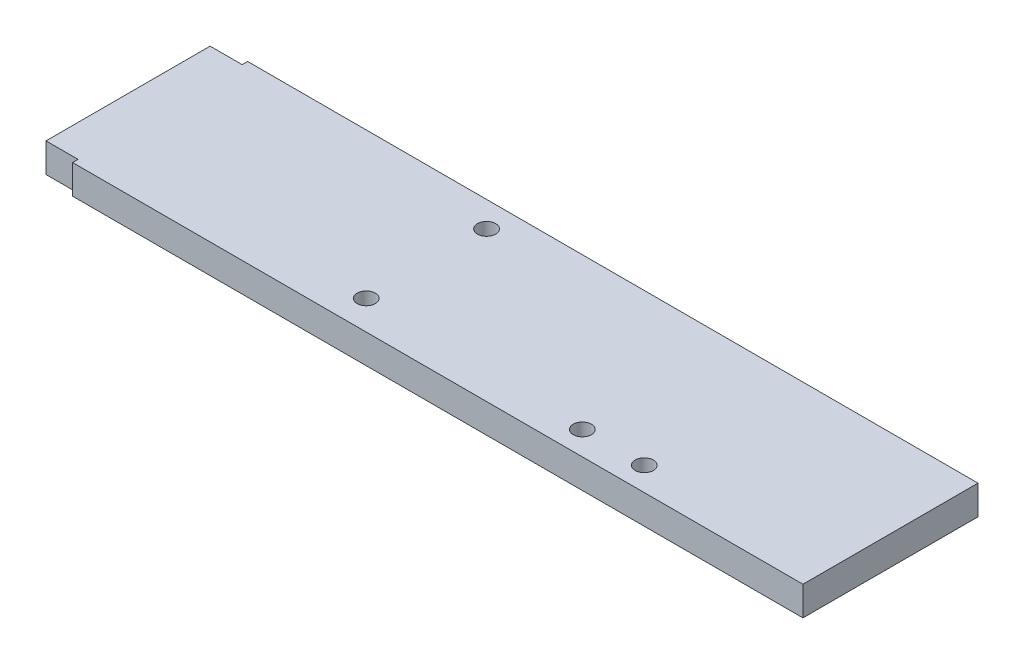
ISO-10303-21;
HEADER;
FILE_DESCRIPTION(('STEP AP214'),'2;1');
FILE_NAME('part.step','',(''),(''),'','','');
FILE_SCHEMA(('AUTOMOTIVE_DESIGN { 1 0 10303 214 1 1 1 1 }'));
ENDSEC;
DATA;
#1=APPLICATION_CONTEXT('core data for automotive mechanical design processes');
#2=APPLICATION_PROTOCOL_DEFINITION('international standard','automotive_design',2000,#1);
#3=PRODUCT_CONTEXT('',#1,'mechanical');
#4=PRODUCT('Part','Part','',(#3));
#5=PRODUCT_RELATED_PRODUCT_CATEGORY('part','',(#4));
#6=PRODUCT_DEFINITION_FORMATION('','',#4);
#7=PRODUCT_DEFINITION_CONTEXT('part definition',#1,'design');
#8=PRODUCT_DEFINITION('design','',#6,#7);
#9=PRODUCT_DEFINITION_SHAPE('','',#8);
#10=(LENGTH_UNIT() NAMED_UNIT(*) SI_UNIT(.MILLI.,.METRE.));
#11=(NAMED_UNIT(*) PLANE_ANGLE_UNIT() SI_UNIT($,.RADIAN.));
#12=(NAMED_UNIT(*) SI_UNIT($,.STERADIAN.) SOLID_ANGLE_UNIT());
#13=UNCERTAINTY_MEASURE_WITH_UNIT(LENGTH_MEASURE(1.E-05),#10,'distance_accuracy_value','');
#14=(GEOMETRIC_REPRESENTATION_CONTEXT(3) GLOBAL_UNCERTAINTY_ASSIGNED_CONTEXT((#13)) GLOBAL_UNIT_ASSIGNED_CONTEXT((#10,
#11,#12)) REPRESENTATION_CONTEXT('',''));
#15=CARTESIAN_POINT('',(0.,0.,0.));
#16=DIRECTION('',(0.,0.,1.));
#17=DIRECTION('',(1.,0.,0.));
#18=AXIS2_PLACEMENT_3D('',#15,#16,#17);
#19=CARTESIAN_POINT('',(-18.7997340759169,1.6,1.81006358972163));
#20=DIRECTION('',(0.,0.,-1.));
#21=DIRECTION('',(-1.,0.,0.));
#22=AXIS2_PLACEMENT_3D('',#19,#20,#21);
#23=PLANE('',#22);
#24=DIRECTION('',(1.,0.,0.));
#25=VECTOR('',#24,1.);
#26=CARTESIAN_POINT('',(-18.7997340759169,0.,1.81006358972163));
#27=LINE('',#26,#25);
#28=CARTESIAN_POINT('',(-18.7997340759169,0.,1.81006358972163));
#29=VERTEX_POINT('',#28);
#30=CARTESIAN_POINT('',(21.2512659240831,0.,1.81006358972163));
#31=VERTEX_POINT('',#30);
#32=EDGE_CURVE('E147',#29,#31,#27,.T.);
#33=ORIENTED_EDGE('',*,*,#32,.F.);
#34=DIRECTION('',(0.,-1.,0.));
#35=VECTOR('',#34,1.);
#36=CARTESIAN_POINT('',(-18.7997340759169,1.6,1.81006358972163));
#37=LINE('',#36,#35);
#38=CARTESIAN_POINT('',(-18.7997340759169,1.6,1.81006358972163));
#39=VERTEX_POINT('',#38);
#40=EDGE_CURVE('E11',#39,#29,#37,.T.);
#41=ORIENTED_EDGE('',*,*,#40,.F.);
#42=DIRECTION('',(1.,0.,0.));
#43=VECTOR('',#42,1.);
#44=CARTESIAN_POINT('',(-18.7997340759169,1.6,1.81006358972163));
#45=LINE('',#44,#43);
#46=CARTESIAN_POINT('',(21.2512659240831,1.6,1.81006358972163));
#47=VERTEX_POINT('',#46);
#48=EDGE_CURVE('E174',#39,#47,#45,.T.);
#49=ORIENTED_EDGE('',*,*,#48,.T.);
#50=DIRECTION('',(0.,-1.,0.));
#51=VECTOR('',#50,1.);
#52=CARTESIAN_POINT('',(21.2512659240831,1.6,1.81006358972163));
#53=LINE('',#52,#51);
#54=EDGE_CURVE('E48',#47,#31,#53,.T.);
#55=ORIENTED_EDGE('',*,*,#54,.T.);
#56=EDGE_LOOP('',(#33,#41,#49,#55));
#57=FACE_BOUND('',#56,.T.);
#58=ADVANCED_FACE('F45',(#57),#23,.T.);
#59=CARTESIAN_POINT('',(-18.7997340759169,1.6,2.11006358972163));
#60=DIRECTION('',(-1.,0.,0.));
#61=DIRECTION('',(0.,0.,1.));
#62=AXIS2_PLACEMENT_3D('',#59,#60,#61);
#63=PLANE('',#62);
#64=DIRECTION('',(0.,0.,-1.));
#65=VECTOR('',#64,1.);
#66=CARTESIAN_POINT('',(-18.7997340759169,0.,2.11006358972163));
#67=LINE('',#66,#65);
#68=CARTESIAN_POINT('',(-18.7997340759169,0.,2.11006358972163));
#69=VERTEX_POINT('',#68);
#70=EDGE_CURVE('E171',#69,#29,#67,.T.);
#71=ORIENTED_EDGE('',*,*,#70,.F.);
#72=DIRECTION('',(0.,-1.,0.));
#73=VECTOR('',#72,1.);
#74=CARTESIAN_POINT('',(-18.7997340759169,1.6,2.11006358972163));
#75=LINE('',#74,#73);
#76=CARTESIAN_POINT('',(-18.7997340759169,1.6,2.11006358972163));
#77=VERTEX_POINT('',#76);
#78=EDGE_CURVE('E55',#77,#69,#75,.T.);
#79=ORIENTED_EDGE('',*,*,#78,.F.);
#80=DIRECTION('',(0.,0.,-1.));
#81=VECTOR('',#80,1.);
#82=CARTESIAN_POINT('',(-18.7997340759169,1.6,2.11006358972163));
#83=LINE('',#82,#81);
#84=EDGE_CURVE('E132',#77,#39,#83,.T.);
#85=ORIENTED_EDGE('',*,*,#84,.T.);
#86=ORIENTED_EDGE('',*,*,#40,.T.);
#87=EDGE_LOOP('',(#71,#79,#85,#86));
#88=FACE_BOUND('',#87,.T.);
#89=ADVANCED_FACE('F195',(#88),#63,.T.);
#90=CARTESIAN_POINT('',(-20.5597340759169,1.6,2.11006358972163));
#91=DIRECTION('',(0.,0.,-1.));
#92=DIRECTION('',(-1.,0.,0.));
#93=AXIS2_PLACEMENT_3D('',#90,#91,#92);
#94=PLANE('',#93);
#95=DIRECTION('',(1.,0.,0.));
#96=VECTOR('',#95,1.);
#97=CARTESIAN_POINT('',(-20.5597340759169,0.,2.11006358972163));
#98=LINE('',#97,#96);
#99=CARTESIAN_POINT('',(-20.5597340759169,0.,2.11006358972163));
#100=VERTEX_POINT('',#99);
#101=EDGE_CURVE('E120',#100,#69,#98,.T.);
#102=ORIENTED_EDGE('',*,*,#101,.F.);
#103=DIRECTION('',(0.,-1.,0.));
#104=VECTOR('',#103,1.);
#105=CARTESIAN_POINT('',(-20.5597340759169,1.6,2.11006358972163));
#106=LINE('',#105,#104);
#107=CARTESIAN_POINT('',(-20.5597340759169,1.6,2.11006358972163));
#108=VERTEX_POINT('',#107);
#109=EDGE_CURVE('E115',#108,#100,#106,.T.);
#110=ORIENTED_EDGE('',*,*,#109,.F.);
#111=DIRECTION('',(1.,0.,0.));
#112=VECTOR('',#111,1.);
#113=CARTESIAN_POINT('',(-20.5597340759169,1.6,2.11006358972163));
#114=LINE('',#113,#112);
#115=EDGE_CURVE('E118',#108,#77,#114,.T.);
#116=ORIENTED_EDGE('',*,*,#115,.T.);
#117=ORIENTED_EDGE('',*,*,#78,.T.);
#118=EDGE_LOOP('',(#102,#110,#116,#117));
#119=FACE_BOUND('',#118,.T.);
#120=ADVANCED_FACE('F117',(#119),#94,.T.);
#121=CARTESIAN_POINT('',(-20.5597340759169,1.6,11.1100635897216));
#122=DIRECTION('',(-1.,0.,0.));
#123=DIRECTION('',(0.,0.,1.));
#124=AXIS2_PLACEMENT_3D('',#121,#122,#123);
#125=PLANE('',#124);
#126=DIRECTION('',(0.,0.,-1.));
#127=VECTOR('',#126,1.);
#128=CARTESIAN_POINT('',(-20.5597340759169,0.,11.1100635897216));
#129=LINE('',#128,#127);
#130=CARTESIAN_POINT('',(-20.5597340759169,0.,11.1100635897216));
#131=VERTEX_POINT('',#130);
#132=EDGE_CURVE('E166',#131,#100,#129,.T.);
#133=ORIENTED_EDGE('',*,*,#132,.F.);
#134=DIRECTION('',(0.,-1.,0.));
#135=VECTOR('',#134,1.);
#136=CARTESIAN_POINT('',(-20.5597340759169,1.6,11.1100635897216));
#137=LINE('',#136,#135);
#138=CARTESIAN_POINT('',(-20.5597340759169,1.6,11.1100635897216));
#139=VERTEX_POINT('',#138);
#140=EDGE_CURVE('E126',#139,#131,#137,.T.);
#141=ORIENTED_EDGE('',*,*,#140,.F.);
#142=DIRECTION('',(0.,0.,-1.));
#143=VECTOR('',#142,1.);
#144=CARTESIAN_POINT('',(-20.5597340759169,1.6,11.1100635897216));
#145=LINE('',#144,#143);
#146=EDGE_CURVE('E131',#139,#108,#145,.T.);
#147=ORIENTED_EDGE('',*,*,#146,.T.);
#148=ORIENTED_EDGE('',*,*,#109,.T.);
#149=EDGE_LOOP('',(#133,#141,#147,#148));
#150=FACE_BOUND('',#149,.T.);
#151=ADVANCED_FACE('F135',(#150),#125,.T.);
#152=CARTESIAN_POINT('',(-20.5597340759169,1.6,11.1100635897216));
#153=DIRECTION('',(0.,0.,-1.));
#154=DIRECTION('',(-1.,0.,0.));
#155=AXIS2_PLACEMENT_3D('',#152,#153,#154);
#156=PLANE('',#155);
#157=DIRECTION('',(1.,0.,0.));
#158=VECTOR('',#157,1.);
#159=CARTESIAN_POINT('',(-20.5597340759169,0.,11.1100635897216));
#160=LINE('',#159,#158);
#161=CARTESIAN_POINT('',(-18.7997340759169,0.,11.1100635897216));
#162=VERTEX_POINT('',#161);
#163=EDGE_CURVE('E163',#131,#162,#160,.T.);
#164=ORIENTED_EDGE('',*,*,#163,.T.);
#165=DIRECTION('',(0.,-1.,0.));
#166=VECTOR('',#165,1.);
#167=CARTESIAN_POINT('',(-18.7997340759169,1.6,11.1100635897216));
#168=LINE('',#167,#166);
#169=CARTESIAN_POINT('',(-18.7997340759169,1.6,11.1100635897216));
#170=VERTEX_POINT('',#169);
#171=EDGE_CURVE('E180',#170,#162,#168,.T.);
#172=ORIENTED_EDGE('',*,*,#171,.F.);
#173=DIRECTION('',(1.,0.,0.));
#174=VECTOR('',#173,1.);
#175=CARTESIAN_POINT('',(-20.5597340759169,1.6,11.1100635897216));
#176=LINE('',#175,#174);
#177=EDGE_CURVE('E138',#139,#170,#176,.T.);
#178=ORIENTED_EDGE('',*,*,#177,.F.);
#179=ORIENTED_EDGE('',*,*,#140,.T.);
#180=EDGE_LOOP('',(#164,#172,#178,#179));
#181=FACE_BOUND('',#180,.T.);
#182=ADVANCED_FACE('F208',(#181),#156,.F.);
#183=CARTESIAN_POINT('',(-18.7997340759169,1.6,11.1100635897216));
#184=DIRECTION('',(1.,0.,0.));
#185=DIRECTION('',(0.,0.,-1.));
#186=AXIS2_PLACEMENT_3D('',#183,#184,#185);
#187=PLANE('',#186);
#188=DIRECTION('',(0.,0.,1.));
#189=VECTOR('',#188,1.);
#190=CARTESIAN_POINT('',(-18.7997340759169,0.,11.1100635897216));
#191=LINE('',#190,#189);
#192=CARTESIAN_POINT('',(-18.7997340759169,0.,11.4100635897216));
#193=VERTEX_POINT('',#192);
#194=EDGE_CURVE('E160',#162,#193,#191,.T.);
#195=ORIENTED_EDGE('',*,*,#194,.T.);
#196=DIRECTION('',(0.,-1.,0.));
#197=VECTOR('',#196,1.);
#198=CARTESIAN_POINT('',(-18.7997340759169,1.6,11.4100635897216));
#199=LINE('',#198,#197);
#200=CARTESIAN_POINT('',(-18.7997340759169,1.6,11.4100635897216));
#201=VERTEX_POINT('',#200);
#202=EDGE_CURVE('E184',#201,#193,#199,.T.);
#203=ORIENTED_EDGE('',*,*,#202,.F.);
#204=DIRECTION('',(0.,0.,1.));
#205=VECTOR('',#204,1.);
#206=CARTESIAN_POINT('',(-18.7997340759169,1.6,11.1100635897216));
#207=LINE('',#206,#205);
#208=EDGE_CURVE('E141',#170,#201,#207,.T.);
#209=ORIENTED_EDGE('',*,*,#208,.F.);
#210=ORIENTED_EDGE('',*,*,#171,.T.);
#211=EDGE_LOOP('',(#195,#203,#209,#210));
#212=FACE_BOUND('',#211,.T.);
#213=ADVANCED_FACE('F211',(#212),#187,.F.);
#214=CARTESIAN_POINT('',(-18.7997340759169,1.6,11.4100635897216));
#215=DIRECTION('',(0.,0.,-1.));
#216=DIRECTION('',(-1.,0.,0.));
#217=AXIS2_PLACEMENT_3D('',#214,#215,#216);
#218=PLANE('',#217);
#219=DIRECTION('',(1.,0.,0.));
#220=VECTOR('',#219,1.);
#221=CARTESIAN_POINT('',(-18.7997340759169,0.,11.4100635897216));
#222=LINE('',#221,#220);
#223=CARTESIAN_POINT('',(21.2512659240831,0.,11.4100635897216));
#224=VERTEX_POINT('',#223);
#225=EDGE_CURVE('E156',#193,#224,#222,.T.);
#226=ORIENTED_EDGE('',*,*,#225,.T.);
#227=DIRECTION('',(0.,-1.,0.));
#228=VECTOR('',#227,1.);
#229=CARTESIAN_POINT('',(21.2512659240831,1.6,11.4100635897216));
#230=LINE('',#229,#228);
#231=CARTESIAN_POINT('',(21.2512659240831,1.6,11.4100635897216));
#232=VERTEX_POINT('',#231);
#233=EDGE_CURVE('E187',#232,#224,#230,.T.);
#234=ORIENTED_EDGE('',*,*,#233,.F.);
#235=DIRECTION('',(1.,0.,0.));
#236=VECTOR('',#235,1.);
#237=CARTESIAN_POINT('',(-18.7997340759169,1.6,11.4100635897216));
#238=LINE('',#237,#236);
#239=EDGE_CURVE('E267',#201,#232,#238,.T.);
#240=ORIENTED_EDGE('',*,*,#239,.F.);
#241=ORIENTED_EDGE('',*,*,#202,.T.);
#242=EDGE_LOOP('',(#226,#234,#240,#241));
#243=FACE_BOUND('',#242,.T.);
#244=ADVANCED_FACE('F215',(#243),#218,.F.);
#245=CARTESIAN_POINT('',(21.2512659240831,1.6,1.81006358972163));
#246=DIRECTION('',(1.,0.,0.));
#247=DIRECTION('',(0.,0.,-1.));
#248=AXIS2_PLACEMENT_3D('',#245,#246,#247);
#249=PLANE('',#248);
#250=DIRECTION('',(0.,0.,1.));
#251=VECTOR('',#250,1.);
#252=CARTESIAN_POINT('',(21.2512659240831,0.,1.81006358972163));
#253=LINE('',#252,#251);
#254=EDGE_CURVE('E151',#31,#224,#253,.T.);
#255=ORIENTED_EDGE('',*,*,#254,.F.);
#256=ORIENTED_EDGE('',*,*,#54,.F.);
#257=DIRECTION('',(0.,0.,1.));
#258=VECTOR('',#257,1.);
#259=CARTESIAN_POINT('',(21.2512659240831,1.6,1.81006358972163));
#260=LINE('',#259,#258);
#261=EDGE_CURVE('E264',#47,#232,#260,.T.);
#262=ORIENTED_EDGE('',*,*,#261,.T.);
#263=ORIENTED_EDGE('',*,*,#233,.T.);
#264=EDGE_LOOP('',(#255,#256,#262,#263));
#265=FACE_BOUND('',#264,.T.);
#266=ADVANCED_FACE('F191',(#265),#249,.T.);
#267=CARTESIAN_POINT('',(0.,1.6,0.));
#268=DIRECTION('',(0.,-1.,0.));
#269=DIRECTION('',(0.,0.,-1.));
#270=AXIS2_PLACEMENT_3D('',#267,#268,#269);
#271=PLANE('',#270);
#272=CARTESIAN_POINT('',(-4.2997343340077,1.6,3.21006223894824));
#273=DIRECTION('',(0.,-1.,0.));
#274=DIRECTION('',(0.,0.,-1.));
#275=AXIS2_PLACEMENT_3D('',#272,#273,#274);
#276=CIRCLE('',#275,0.499999999999999);
#277=CARTESIAN_POINT('',(-4.2997343340077,1.6,2.71006223894824));
#278=VERTEX_POINT('',#277);
#279=EDGE_CURVE('E152',#278,#278,#276,.T.);
#280=ORIENTED_EDGE('',*,*,#279,.T.);
#281=EDGE_LOOP('',(#280));
#282=FACE_BOUND('',#281,.T.);
#283=CARTESIAN_POINT('',(-4.2997343340077,1.6,9.81006223894824));
#284=DIRECTION('',(0.,-1.,0.));
#285=DIRECTION('',(0.,0.,-1.));
#286=AXIS2_PLACEMENT_3D('',#283,#284,#285);
#287=CIRCLE('',#286,0.499999999999999);
#288=CARTESIAN_POINT('',(-4.2997343340077,1.6,9.31006223894824));
#289=VERTEX_POINT('',#288);
#290=EDGE_CURVE('E254',#289,#289,#287,.T.);
#291=ORIENTED_EDGE('',*,*,#290,.T.);
#292=EDGE_LOOP('',(#291));
#293=FACE_BOUND('',#292,.T.);
#294=CARTESIAN_POINT('',(7.85126566599229,1.6,10.1100622389482));
#295=DIRECTION('',(0.,-1.,0.));
#296=DIRECTION('',(0.,0.,-1.));
#297=AXIS2_PLACEMENT_3D('',#294,#295,#296);
#298=CIRCLE('',#297,0.500000000000004);
#299=CARTESIAN_POINT('',(7.85126566599229,1.6,9.61006223894823));
#300=VERTEX_POINT('',#299);
#301=EDGE_CURVE('E258',#300,#300,#298,.T.);
#302=ORIENTED_EDGE('',*,*,#301,.T.);
#303=EDGE_LOOP('',(#302));
#304=FACE_BOUND('',#303,.T.);
#305=CARTESIAN_POINT('',(11.2512656659923,1.6,10.1100622389482));
#306=DIRECTION('',(0.,-1.,0.));
#307=DIRECTION('',(0.,0.,-1.));
#308=AXIS2_PLACEMENT_3D('',#305,#306,#307);
#309=CIRCLE('',#308,0.500000000000003);
#310=CARTESIAN_POINT('',(11.2512656659923,1.6,9.61006223894824));
#311=VERTEX_POINT('',#310);
#312=EDGE_CURVE('E279',#311,#311,#309,.T.);
#313=ORIENTED_EDGE('',*,*,#312,.T.);
#314=EDGE_LOOP('',(#313));
#315=FACE_BOUND('',#314,.T.);
#316=ORIENTED_EDGE('',*,*,#48,.F.);
#317=ORIENTED_EDGE('',*,*,#84,.F.);
#318=ORIENTED_EDGE('',*,*,#115,.F.);
#319=ORIENTED_EDGE('',*,*,#146,.F.);
#320=ORIENTED_EDGE('',*,*,#177,.T.);
#321=ORIENTED_EDGE('',*,*,#208,.T.);
#322=ORIENTED_EDGE('',*,*,#239,.T.);
#323=ORIENTED_EDGE('',*,*,#261,.F.);
#324=EDGE_LOOP('',(#316,#317,#318,#319,#320,#321,#322,#323));
#325=FACE_BOUND('',#324,.T.);
#326=ADVANCED_FACE('F130',(#282,#293,#304,#315,#325),#271,.F.);
#327=CARTESIAN_POINT('',(0.,0.,0.));
#328=DIRECTION('',(0.,-1.,0.));
#329=DIRECTION('',(0.,0.,-1.));
#330=AXIS2_PLACEMENT_3D('',#327,#328,#329);
#331=PLANE('',#330);
#332=CARTESIAN_POINT('',(-4.2997343340077,0.,3.21006223894824));
#333=DIRECTION('',(0.,1.,0.));
#334=DIRECTION('',(0.,0.,1.));
#335=AXIS2_PLACEMENT_3D('',#332,#333,#334);
#336=CIRCLE('',#335,0.499999999999999);
#337=CARTESIAN_POINT('',(-4.2997343340077,0.,3.71006223894824));
#338=VERTEX_POINT('',#337);
#339=EDGE_CURVE('E251',#338,#338,#336,.T.);
#340=ORIENTED_EDGE('',*,*,#339,.T.);
#341=EDGE_LOOP('',(#340));
#342=FACE_BOUND('',#341,.T.);
#343=CARTESIAN_POINT('',(-4.2997343340077,0.,9.81006223894824));
#344=DIRECTION('',(0.,1.,0.));
#345=DIRECTION('',(0.,0.,1.));
#346=AXIS2_PLACEMENT_3D('',#343,#344,#345);
#347=CIRCLE('',#346,0.499999999999999);
#348=CARTESIAN_POINT('',(-4.2997343340077,0.,10.3100622389482));
#349=VERTEX_POINT('',#348);
#350=EDGE_CURVE('E291',#349,#349,#347,.T.);
#351=ORIENTED_EDGE('',*,*,#350,.T.);
#352=EDGE_LOOP('',(#351));
#353=FACE_BOUND('',#352,.T.);
#354=CARTESIAN_POINT('',(7.85126566599229,0.,10.1100622389482));
#355=DIRECTION('',(0.,1.,0.));
#356=DIRECTION('',(0.,0.,1.));
#357=AXIS2_PLACEMENT_3D('',#354,#355,#356);
#358=CIRCLE('',#357,0.500000000000004);
#359=CARTESIAN_POINT('',(7.85126566599229,0.,10.6100622389482));
#360=VERTEX_POINT('',#359);
#361=EDGE_CURVE('E287',#360,#360,#358,.T.);
#362=ORIENTED_EDGE('',*,*,#361,.T.);
#363=EDGE_LOOP('',(#362));
#364=FACE_BOUND('',#363,.T.);
#365=CARTESIAN_POINT('',(11.2512656659923,0.,10.1100622389482));
#366=DIRECTION('',(0.,1.,0.));
#367=DIRECTION('',(0.,0.,1.));
#368=AXIS2_PLACEMENT_3D('',#365,#366,#367);
#369=CIRCLE('',#368,0.500000000000003);
#370=CARTESIAN_POINT('',(11.2512656659923,0.,10.6100622389482));
#371=VERTEX_POINT('',#370);
#372=EDGE_CURVE('E283',#371,#371,#369,.T.);
#373=ORIENTED_EDGE('',*,*,#372,.T.);
#374=EDGE_LOOP('',(#373));
#375=FACE_BOUND('',#374,.T.);
#376=ORIENTED_EDGE('',*,*,#32,.T.);
#377=ORIENTED_EDGE('',*,*,#254,.T.);
#378=ORIENTED_EDGE('',*,*,#225,.F.);
#379=ORIENTED_EDGE('',*,*,#194,.F.);
#380=ORIENTED_EDGE('',*,*,#163,.F.);
#381=ORIENTED_EDGE('',*,*,#132,.T.);
#382=ORIENTED_EDGE('',*,*,#101,.T.);
#383=ORIENTED_EDGE('',*,*,#70,.T.);
#384=EDGE_LOOP('',(#376,#377,#378,#379,#380,#381,#382,#383));
#385=FACE_BOUND('',#384,.T.);
#386=ADVANCED_FACE('F194',(#342,#353,#364,#375,#385),#331,.T.);
#387=CARTESIAN_POINT('',(11.2512656659923,0.,10.1100622389482));
#388=DIRECTION('',(0.,1.,0.));
#389=DIRECTION('',(0.,0.,1.));
#390=AXIS2_PLACEMENT_3D('',#387,#388,#389);
#391=CYLINDRICAL_SURFACE('',#390,0.500000000000003);
#392=ORIENTED_EDGE('',*,*,#372,.F.);
#393=EDGE_LOOP('',(#392));
#394=FACE_BOUND('',#393,.T.);
#395=ORIENTED_EDGE('',*,*,#312,.F.);
#396=EDGE_LOOP('',(#395));
#397=FACE_BOUND('',#396,.T.);
#398=ADVANCED_FACE('F227',(#394,#397),#391,.F.);
#399=CARTESIAN_POINT('',(7.85126566599229,0.,10.1100622389482));
#400=DIRECTION('',(0.,1.,0.));
#401=DIRECTION('',(0.,0.,1.));
#402=AXIS2_PLACEMENT_3D('',#399,#400,#401);
#403=CYLINDRICAL_SURFACE('',#402,0.500000000000004);
#404=ORIENTED_EDGE('',*,*,#361,.F.);
#405=EDGE_LOOP('',(#404));
#406=FACE_BOUND('',#405,.T.);
#407=ORIENTED_EDGE('',*,*,#301,.F.);
#408=EDGE_LOOP('',(#407));
#409=FACE_BOUND('',#408,.T.);
#410=ADVANCED_FACE('F234',(#406,#409),#403,.F.);
#411=CARTESIAN_POINT('',(-4.2997343340077,0.,9.81006223894824));
#412=DIRECTION('',(0.,1.,0.));
#413=DIRECTION('',(0.,0.,1.));
#414=AXIS2_PLACEMENT_3D('',#411,#412,#413);
#415=CYLINDRICAL_SURFACE('',#414,0.499999999999999);
#416=ORIENTED_EDGE('',*,*,#350,.F.);
#417=EDGE_LOOP('',(#416));
#418=FACE_BOUND('',#417,.T.);
#419=ORIENTED_EDGE('',*,*,#290,.F.);
#420=EDGE_LOOP('',(#419));
#421=FACE_BOUND('',#420,.T.);
#422=ADVANCED_FACE('F238',(#418,#421),#415,.F.);
#423=CARTESIAN_POINT('',(-4.2997343340077,0.,3.21006223894824));
#424=DIRECTION('',(0.,1.,0.));
#425=DIRECTION('',(0.,0.,1.));
#426=AXIS2_PLACEMENT_3D('',#423,#424,#425);
#427=CYLINDRICAL_SURFACE('',#426,0.499999999999999);
#428=ORIENTED_EDGE('',*,*,#339,.F.);
#429=EDGE_LOOP('',(#428));
#430=FACE_BOUND('',#429,.T.);
#431=ORIENTED_EDGE('',*,*,#279,.F.);
#432=EDGE_LOOP('',(#431));
#433=FACE_BOUND('',#432,.T.);
#434=ADVANCED_FACE('F242',(#430,#433),#427,.F.);
#435=CLOSED_SHELL('',(#58,#89,#120,#151,#182,#213,#244,#266,#326,#386,#398,#410,#422,#434));
#436=MANIFOLD_SOLID_BREP('B2',#435);
#437=ADVANCED_BREP_SHAPE_REPRESENTATION('',(#18,#436),#14);
#438=SHAPE_DEFINITION_REPRESENTATION(#9,#437);
ENDSEC;
END-ISO-10303-21;
